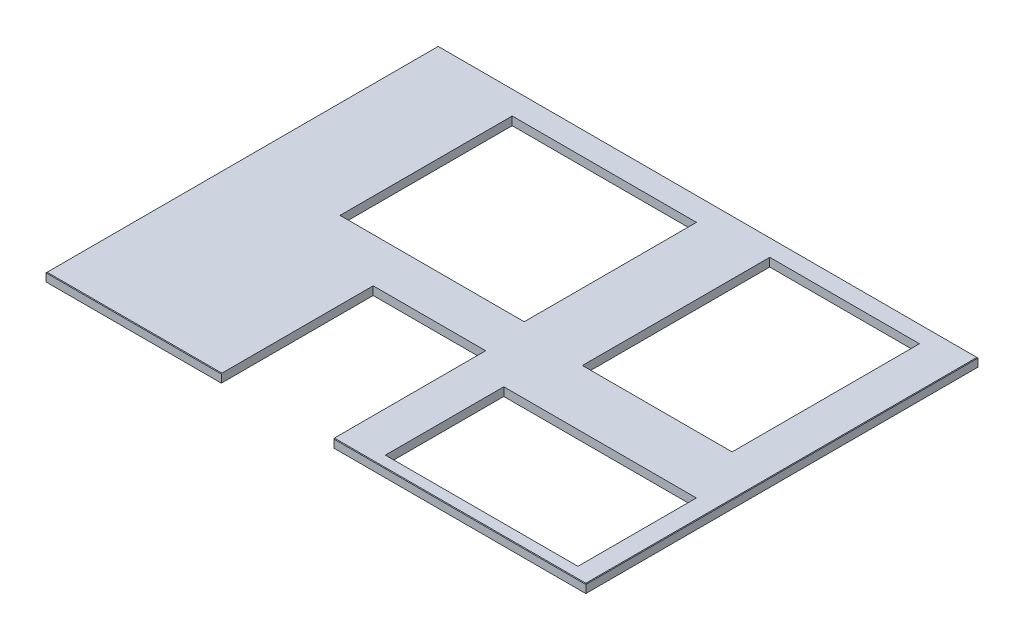
ISO-10303-21;
HEADER;
FILE_DESCRIPTION(('STEP AP214'),'2;1');
FILE_NAME('part.step','',(''),(''),'','','');
FILE_SCHEMA(('AUTOMOTIVE_DESIGN { 1 0 10303 214 1 1 1 1 }'));
ENDSEC;
DATA;
#1=APPLICATION_CONTEXT('core data for automotive mechanical design processes');
#2=APPLICATION_PROTOCOL_DEFINITION('international standard','automotive_design',2000,#1);
#3=PRODUCT_CONTEXT('',#1,'mechanical');
#4=PRODUCT('Part','Part','',(#3));
#5=PRODUCT_RELATED_PRODUCT_CATEGORY('part','',(#4));
#6=PRODUCT_DEFINITION_FORMATION('','',#4);
#7=PRODUCT_DEFINITION_CONTEXT('part definition',#1,'design');
#8=PRODUCT_DEFINITION('design','',#6,#7);
#9=PRODUCT_DEFINITION_SHAPE('','',#8);
#10=(LENGTH_UNIT() NAMED_UNIT(*) SI_UNIT(.MILLI.,.METRE.));
#11=(NAMED_UNIT(*) PLANE_ANGLE_UNIT() SI_UNIT($,.RADIAN.));
#12=(NAMED_UNIT(*) SI_UNIT($,.STERADIAN.) SOLID_ANGLE_UNIT());
#13=UNCERTAINTY_MEASURE_WITH_UNIT(LENGTH_MEASURE(1.E-05),#10,'distance_accuracy_value','');
#14=(GEOMETRIC_REPRESENTATION_CONTEXT(3) GLOBAL_UNCERTAINTY_ASSIGNED_CONTEXT((#13)) GLOBAL_UNIT_ASSIGNED_CONTEXT((#10,
#11,#12)) REPRESENTATION_CONTEXT('',''));
#15=CARTESIAN_POINT('',(0.,0.,0.));
#16=DIRECTION('',(0.,0.,1.));
#17=DIRECTION('',(1.,0.,0.));
#18=AXIS2_PLACEMENT_3D('',#15,#16,#17);
#19=CARTESIAN_POINT('',(0.,-38.1,0.));
#20=DIRECTION('',(0.,0.,1.));
#21=DIRECTION('',(1.,0.,0.));
#22=AXIS2_PLACEMENT_3D('',#19,#20,#21);
#23=PLANE('',#22);
#24=DIRECTION('',(0.,1.,0.));
#25=VECTOR('',#24,1.);
#26=CARTESIAN_POINT('',(792.1625,-38.1,0.));
#27=LINE('',#26,#25);
#28=CARTESIAN_POINT('',(792.1625,-38.1,0.));
#29=VERTEX_POINT('',#28);
#30=CARTESIAN_POINT('',(792.1625,-2.54000000000022,0.));
#31=VERTEX_POINT('',#30);
#32=EDGE_CURVE('E274',#29,#31,#27,.T.);
#33=ORIENTED_EDGE('',*,*,#32,.T.);
#34=DIRECTION('',(-1.,0.,0.));
#35=VECTOR('',#34,1.);
#36=CARTESIAN_POINT('',(0.,-2.54000000000021,0.));
#37=LINE('',#36,#35);
#38=CARTESIAN_POINT('',(0.,-2.54000000000022,0.));
#39=VERTEX_POINT('',#38);
#40=EDGE_CURVE('E365',#31,#39,#37,.T.);
#41=ORIENTED_EDGE('',*,*,#40,.T.);
#42=DIRECTION('',(0.,1.,0.));
#43=VECTOR('',#42,1.);
#44=CARTESIAN_POINT('',(0.,-38.1,0.));
#45=LINE('',#44,#43);
#46=CARTESIAN_POINT('',(0.,-38.1,0.));
#47=VERTEX_POINT('',#46);
#48=EDGE_CURVE('E336',#47,#39,#45,.T.);
#49=ORIENTED_EDGE('',*,*,#48,.F.);
#50=DIRECTION('',(1.,0.,0.));
#51=VECTOR('',#50,1.);
#52=CARTESIAN_POINT('',(0.,-38.1,0.));
#53=LINE('',#52,#51);
#54=EDGE_CURVE('E322',#47,#29,#53,.T.);
#55=ORIENTED_EDGE('',*,*,#54,.T.);
#56=EDGE_LOOP('',(#33,#41,#49,#55));
#57=FACE_BOUND('',#56,.T.);
#58=ADVANCED_FACE('F40',(#57),#23,.T.);
#59=CARTESIAN_POINT('',(0.,0.,-2.53999999999976));
#60=DIRECTION('',(0.,-0.707106781186485,-0.707106781186609));
#61=DIRECTION('',(1.,0.,0.));
#62=AXIS2_PLACEMENT_3D('',#59,#60,#61);
#63=PLANE('',#62);
#64=DIRECTION('',(0.,0.70710678118661,-0.707106781186486));
#65=VECTOR('',#64,1.);
#66=CARTESIAN_POINT('',(792.1625,0.,-2.53999999999983));
#67=LINE('',#66,#65);
#68=CARTESIAN_POINT('',(792.1625,0.,-2.53999999999976));
#69=VERTEX_POINT('',#68);
#70=EDGE_CURVE('E11',#69,#31,#67,.F.);
#71=ORIENTED_EDGE('',*,*,#70,.F.);
#72=DIRECTION('',(1.,0.,0.));
#73=VECTOR('',#72,1.);
#74=CARTESIAN_POINT('',(0.,0.,-2.53999999999976));
#75=LINE('',#74,#73);
#76=CARTESIAN_POINT('',(2.53999999999976,0.,-2.53999999999976));
#77=VERTEX_POINT('',#76);
#78=EDGE_CURVE('E348',#77,#69,#75,.T.);
#79=ORIENTED_EDGE('',*,*,#78,.F.);
#80=DIRECTION('',(-0.577350269189592,-0.577350269189693,0.577350269189592));
#81=VECTOR('',#80,1.);
#82=CARTESIAN_POINT('',(1.69333333333327,-0.846666666666637,-1.69333333333327));
#83=LINE('',#82,#81);
#84=EDGE_CURVE('E315',#39,#77,#83,.F.);
#85=ORIENTED_EDGE('',*,*,#84,.F.);
#86=ORIENTED_EDGE('',*,*,#40,.F.);
#87=EDGE_LOOP('',(#71,#79,#85,#86));
#88=FACE_BOUND('',#87,.T.);
#89=ADVANCED_FACE('F410',(#88),#63,.F.);
#90=DIRECTION('',(0.,1.,0.));
#91=VECTOR('',#90,1.);
#92=CARTESIAN_POINT('',(1300.1625,-38.1,0.));
#93=LINE('',#92,#91);
#94=CARTESIAN_POINT('',(1300.1625,-38.1,0.));
#95=VERTEX_POINT('',#94);
#96=CARTESIAN_POINT('',(1300.1625,-2.54000000000021,0.));
#97=VERTEX_POINT('',#96);
#98=EDGE_CURVE('E286',#95,#97,#93,.T.);
#99=ORIENTED_EDGE('',*,*,#98,.F.);
#100=CARTESIAN_POINT('',(2438.4,-38.1,0.));
#101=VERTEX_POINT('',#100);
#102=EDGE_CURVE('E326',#95,#101,#53,.T.);
#103=ORIENTED_EDGE('',*,*,#102,.T.);
#104=DIRECTION('',(0.,1.,0.));
#105=VECTOR('',#104,1.);
#106=CARTESIAN_POINT('',(2438.4,-38.1,0.));
#107=LINE('',#106,#105);
#108=CARTESIAN_POINT('',(2438.4,-2.54000000000022,0.));
#109=VERTEX_POINT('',#108);
#110=EDGE_CURVE('E335',#101,#109,#107,.T.);
#111=ORIENTED_EDGE('',*,*,#110,.T.);
#112=EDGE_CURVE('E366',#109,#97,#37,.T.);
#113=ORIENTED_EDGE('',*,*,#112,.T.);
#114=EDGE_LOOP('',(#99,#103,#111,#113));
#115=FACE_BOUND('',#114,.T.);
#116=ADVANCED_FACE('F420',(#115),#23,.T.);
#117=CARTESIAN_POINT('',(0.,-38.1,-1771.65));
#118=DIRECTION('',(-1.,0.,0.));
#119=DIRECTION('',(0.,0.,1.));
#120=AXIS2_PLACEMENT_3D('',#117,#118,#119);
#121=PLANE('',#120);
#122=ORIENTED_EDGE('',*,*,#48,.T.);
#123=DIRECTION('',(0.,0.,-1.));
#124=VECTOR('',#123,1.);
#125=CARTESIAN_POINT('',(0.,-2.54000000000021,-1771.65));
#126=LINE('',#125,#124);
#127=CARTESIAN_POINT('',(0.,-2.54000000000022,-1771.65));
#128=VERTEX_POINT('',#127);
#129=EDGE_CURVE('E358',#39,#128,#126,.T.);
#130=ORIENTED_EDGE('',*,*,#129,.T.);
#131=DIRECTION('',(0.,1.,0.));
#132=VECTOR('',#131,1.);
#133=CARTESIAN_POINT('',(0.,-38.1,-1771.65));
#134=LINE('',#133,#132);
#135=CARTESIAN_POINT('',(0.,-38.1,-1771.65));
#136=VERTEX_POINT('',#135);
#137=EDGE_CURVE('E340',#136,#128,#134,.T.);
#138=ORIENTED_EDGE('',*,*,#137,.F.);
#139=DIRECTION('',(0.,0.,1.));
#140=VECTOR('',#139,1.);
#141=CARTESIAN_POINT('',(0.,-38.1,-1771.65));
#142=LINE('',#141,#140);
#143=EDGE_CURVE('E332',#136,#47,#142,.T.);
#144=ORIENTED_EDGE('',*,*,#143,.T.);
#145=EDGE_LOOP('',(#122,#130,#138,#144));
#146=FACE_BOUND('',#145,.T.);
#147=ADVANCED_FACE('F430',(#146),#121,.T.);
#148=CARTESIAN_POINT('',(2438.4,-38.1,-1771.65));
#149=DIRECTION('',(0.,0.,-1.));
#150=DIRECTION('',(-1.,0.,0.));
#151=AXIS2_PLACEMENT_3D('',#148,#149,#150);
#152=PLANE('',#151);
#153=ORIENTED_EDGE('',*,*,#137,.T.);
#154=DIRECTION('',(1.,0.,0.));
#155=VECTOR('',#154,1.);
#156=CARTESIAN_POINT('',(2438.4,-2.54000000000021,-1771.65));
#157=LINE('',#156,#155);
#158=CARTESIAN_POINT('',(2438.4,-2.54000000000022,-1771.65));
#159=VERTEX_POINT('',#158);
#160=EDGE_CURVE('E361',#128,#159,#157,.T.);
#161=ORIENTED_EDGE('',*,*,#160,.T.);
#162=DIRECTION('',(0.,1.,0.));
#163=VECTOR('',#162,1.);
#164=CARTESIAN_POINT('',(2438.4,-38.1,-1771.65));
#165=LINE('',#164,#163);
#166=CARTESIAN_POINT('',(2438.4,-38.1,-1771.65));
#167=VERTEX_POINT('',#166);
#168=EDGE_CURVE('E343',#167,#159,#165,.T.);
#169=ORIENTED_EDGE('',*,*,#168,.F.);
#170=DIRECTION('',(-1.,0.,0.));
#171=VECTOR('',#170,1.);
#172=CARTESIAN_POINT('',(2438.4,-38.1,-1771.65));
#173=LINE('',#172,#171);
#174=EDGE_CURVE('E329',#167,#136,#173,.T.);
#175=ORIENTED_EDGE('',*,*,#174,.T.);
#176=EDGE_LOOP('',(#153,#161,#169,#175));
#177=FACE_BOUND('',#176,.T.);
#178=ADVANCED_FACE('F428',(#177),#152,.T.);
#179=CARTESIAN_POINT('',(2438.4,-38.1,0.));
#180=DIRECTION('',(1.,0.,0.));
#181=DIRECTION('',(0.,0.,-1.));
#182=AXIS2_PLACEMENT_3D('',#179,#180,#181);
#183=PLANE('',#182);
#184=ORIENTED_EDGE('',*,*,#168,.T.);
#185=DIRECTION('',(0.,0.,1.));
#186=VECTOR('',#185,1.);
#187=CARTESIAN_POINT('',(2438.4,-2.54000000000021,0.));
#188=LINE('',#187,#186);
#189=EDGE_CURVE('E363',#159,#109,#188,.T.);
#190=ORIENTED_EDGE('',*,*,#189,.T.);
#191=ORIENTED_EDGE('',*,*,#110,.F.);
#192=DIRECTION('',(0.,0.,-1.));
#193=VECTOR('',#192,1.);
#194=CARTESIAN_POINT('',(2438.4,-38.1,0.));
#195=LINE('',#194,#193);
#196=EDGE_CURVE('E325',#101,#167,#195,.T.);
#197=ORIENTED_EDGE('',*,*,#196,.T.);
#198=EDGE_LOOP('',(#184,#190,#191,#197));
#199=FACE_BOUND('',#198,.T.);
#200=ADVANCED_FACE('F426',(#199),#183,.T.);
#201=CARTESIAN_POINT('',(0.,-38.1,0.));
#202=DIRECTION('',(0.,1.,0.));
#203=DIRECTION('',(0.,0.,1.));
#204=AXIS2_PLACEMENT_3D('',#201,#202,#203);
#205=PLANE('',#204);
#206=DIRECTION('',(-1.,0.,0.));
#207=VECTOR('',#206,1.);
#208=CARTESIAN_POINT('',(441.799591690838,-38.1,-1664.06281503777));
#209=LINE('',#208,#207);
#210=CARTESIAN_POINT('',(1273.97070203891,-38.1,-1664.06281503777));
#211=VERTEX_POINT('',#210);
#212=CARTESIAN_POINT('',(441.799591690838,-38.1,-1664.06281503777));
#213=VERTEX_POINT('',#212);
#214=EDGE_CURVE('E203',#211,#213,#209,.T.);
#215=ORIENTED_EDGE('',*,*,#214,.T.);
#216=DIRECTION('',(0.,0.,1.));
#217=VECTOR('',#216,1.);
#218=CARTESIAN_POINT('',(441.799591690838,-38.1,-1664.06281503777));
#219=LINE('',#218,#217);
#220=CARTESIAN_POINT('',(441.799591690838,-38.1,-886.357665072126));
#221=VERTEX_POINT('',#220);
#222=EDGE_CURVE('E197',#213,#221,#219,.T.);
#223=ORIENTED_EDGE('',*,*,#222,.T.);
#224=DIRECTION('',(1.,0.,0.));
#225=VECTOR('',#224,1.);
#226=CARTESIAN_POINT('',(441.799591690838,-38.1,-886.357665072126));
#227=LINE('',#226,#225);
#228=CARTESIAN_POINT('',(1273.97070203891,-38.1,-886.357665072126));
#229=VERTEX_POINT('',#228);
#230=EDGE_CURVE('E206',#221,#229,#227,.T.);
#231=ORIENTED_EDGE('',*,*,#230,.T.);
#232=DIRECTION('',(0.,0.,-1.));
#233=VECTOR('',#232,1.);
#234=CARTESIAN_POINT('',(1273.97070203891,-38.1,-1664.06281503777));
#235=LINE('',#234,#233);
#236=EDGE_CURVE('E56',#229,#211,#235,.T.);
#237=ORIENTED_EDGE('',*,*,#236,.T.);
#238=EDGE_LOOP('',(#215,#223,#231,#237));
#239=FACE_BOUND('',#238,.T.);
#240=DIRECTION('',(1.,0.,0.));
#241=VECTOR('',#240,1.);
#242=CARTESIAN_POINT('',(1576.4256,-38.1,-846.57692));
#243=LINE('',#242,#241);
#244=CARTESIAN_POINT('',(1576.4256,-38.1,-846.57692));
#245=VERTEX_POINT('',#244);
#246=CARTESIAN_POINT('',(2252.62694,-38.1,-846.57692));
#247=VERTEX_POINT('',#246);
#248=EDGE_CURVE('E242',#245,#247,#243,.T.);
#249=ORIENTED_EDGE('',*,*,#248,.T.);
#250=DIRECTION('',(0.,0.,-1.));
#251=VECTOR('',#250,1.);
#252=CARTESIAN_POINT('',(2252.62694,-38.1,-1692.91));
#253=LINE('',#252,#251);
#254=CARTESIAN_POINT('',(2252.62694,-38.1,-1692.91));
#255=VERTEX_POINT('',#254);
#256=EDGE_CURVE('E232',#247,#255,#253,.T.);
#257=ORIENTED_EDGE('',*,*,#256,.T.);
#258=DIRECTION('',(-1.,0.,0.));
#259=VECTOR('',#258,1.);
#260=CARTESIAN_POINT('',(1576.4256,-38.1,-1692.91));
#261=LINE('',#260,#259);
#262=CARTESIAN_POINT('',(1576.4256,-38.1,-1692.91));
#263=VERTEX_POINT('',#262);
#264=EDGE_CURVE('E235',#255,#263,#261,.T.);
#265=ORIENTED_EDGE('',*,*,#264,.T.);
#266=DIRECTION('',(0.,0.,1.));
#267=VECTOR('',#266,1.);
#268=CARTESIAN_POINT('',(1576.4256,-38.1,-1692.91));
#269=LINE('',#268,#267);
#270=EDGE_CURVE('E239',#263,#245,#269,.T.);
#271=ORIENTED_EDGE('',*,*,#270,.T.);
#272=EDGE_LOOP('',(#249,#257,#265,#271));
#273=FACE_BOUND('',#272,.T.);
#274=DIRECTION('',(1.,0.,0.));
#275=VECTOR('',#274,1.);
#276=CARTESIAN_POINT('',(1482.09,-38.1,-50.8));
#277=LINE('',#276,#275);
#278=CARTESIAN_POINT('',(1482.09,-38.1,-50.8));
#279=VERTEX_POINT('',#278);
#280=CARTESIAN_POINT('',(2352.04,-38.1,-50.8));
#281=VERTEX_POINT('',#280);
#282=EDGE_CURVE('E300',#279,#281,#277,.T.);
#283=ORIENTED_EDGE('',*,*,#282,.T.);
#284=DIRECTION('',(0.,0.,-1.));
#285=VECTOR('',#284,1.);
#286=CARTESIAN_POINT('',(2352.04,-38.1,-585.7875));
#287=LINE('',#286,#285);
#288=CARTESIAN_POINT('',(2352.04,-38.1,-585.7875));
#289=VERTEX_POINT('',#288);
#290=EDGE_CURVE('E290',#281,#289,#287,.T.);
#291=ORIENTED_EDGE('',*,*,#290,.T.);
#292=DIRECTION('',(-1.,0.,0.));
#293=VECTOR('',#292,1.);
#294=CARTESIAN_POINT('',(1482.09,-38.1,-585.7875));
#295=LINE('',#294,#293);
#296=CARTESIAN_POINT('',(1482.09,-38.1,-585.7875));
#297=VERTEX_POINT('',#296);
#298=EDGE_CURVE('E293',#289,#297,#295,.T.);
#299=ORIENTED_EDGE('',*,*,#298,.T.);
#300=DIRECTION('',(0.,0.,1.));
#301=VECTOR('',#300,1.);
#302=CARTESIAN_POINT('',(1482.09,-38.1,-585.7875));
#303=LINE('',#302,#301);
#304=EDGE_CURVE('E297',#297,#279,#303,.T.);
#305=ORIENTED_EDGE('',*,*,#304,.T.);
#306=EDGE_LOOP('',(#283,#291,#299,#305));
#307=FACE_BOUND('',#306,.T.);
#308=DIRECTION('',(-1.,0.,0.));
#309=VECTOR('',#308,1.);
#310=CARTESIAN_POINT('',(792.1625,-38.1,-685.8));
#311=LINE('',#310,#309);
#312=CARTESIAN_POINT('',(1300.1625,-38.1,-685.8));
#313=VERTEX_POINT('',#312);
#314=CARTESIAN_POINT('',(792.1625,-38.1,-685.8));
#315=VERTEX_POINT('',#314);
#316=EDGE_CURVE('E271',#313,#315,#311,.T.);
#317=ORIENTED_EDGE('',*,*,#316,.T.);
#318=DIRECTION('',(0.,0.,1.));
#319=VECTOR('',#318,1.);
#320=CARTESIAN_POINT('',(792.1625,-38.1,-685.8));
#321=LINE('',#320,#319);
#322=EDGE_CURVE('E264',#315,#29,#321,.T.);
#323=ORIENTED_EDGE('',*,*,#322,.T.);
#324=ORIENTED_EDGE('',*,*,#54,.F.);
#325=ORIENTED_EDGE('',*,*,#143,.F.);
#326=ORIENTED_EDGE('',*,*,#174,.F.);
#327=ORIENTED_EDGE('',*,*,#196,.F.);
#328=ORIENTED_EDGE('',*,*,#102,.F.);
#329=DIRECTION('',(0.,0.,-1.));
#330=VECTOR('',#329,1.);
#331=CARTESIAN_POINT('',(1300.1625,-38.1,-685.8));
#332=LINE('',#331,#330);
#333=EDGE_CURVE('E267',#95,#313,#332,.T.);
#334=ORIENTED_EDGE('',*,*,#333,.T.);
#335=EDGE_LOOP('',(#317,#323,#324,#325,#326,#327,#328,#334));
#336=FACE_BOUND('',#335,.T.);
#337=ADVANCED_FACE('F210',(#239,#273,#307,#336),#205,.F.);
#338=CARTESIAN_POINT('',(0.,0.,0.));
#339=DIRECTION('',(0.,1.,0.));
#340=DIRECTION('',(0.,0.,1.));
#341=AXIS2_PLACEMENT_3D('',#338,#339,#340);
#342=PLANE('',#341);
#343=DIRECTION('',(0.,0.,1.));
#344=VECTOR('',#343,1.);
#345=CARTESIAN_POINT('',(441.799591690838,0.,-1664.06281503777));
#346=LINE('',#345,#344);
#347=CARTESIAN_POINT('',(441.799591690838,0.,-1664.06281503777));
#348=VERTEX_POINT('',#347);
#349=CARTESIAN_POINT('',(441.799591690838,0.,-886.357665072126));
#350=VERTEX_POINT('',#349);
#351=EDGE_CURVE('E64',#348,#350,#346,.T.);
#352=ORIENTED_EDGE('',*,*,#351,.F.);
#353=DIRECTION('',(-1.,0.,0.));
#354=VECTOR('',#353,1.);
#355=CARTESIAN_POINT('',(441.799591690838,0.,-1664.06281503777));
#356=LINE('',#355,#354);
#357=CARTESIAN_POINT('',(1273.97070203891,0.,-1664.06281503777));
#358=VERTEX_POINT('',#357);
#359=EDGE_CURVE('E213',#358,#348,#356,.T.);
#360=ORIENTED_EDGE('',*,*,#359,.F.);
#361=DIRECTION('',(0.,0.,-1.));
#362=VECTOR('',#361,1.);
#363=CARTESIAN_POINT('',(1273.97070203891,0.,-1664.06281503777));
#364=LINE('',#363,#362);
#365=CARTESIAN_POINT('',(1273.97070203891,0.,-886.357665072126));
#366=VERTEX_POINT('',#365);
#367=EDGE_CURVE('E216',#366,#358,#364,.T.);
#368=ORIENTED_EDGE('',*,*,#367,.F.);
#369=DIRECTION('',(1.,0.,0.));
#370=VECTOR('',#369,1.);
#371=CARTESIAN_POINT('',(441.799591690838,0.,-886.357665072126));
#372=LINE('',#371,#370);
#373=EDGE_CURVE('E222',#350,#366,#372,.T.);
#374=ORIENTED_EDGE('',*,*,#373,.F.);
#375=EDGE_LOOP('',(#352,#360,#368,#374));
#376=FACE_BOUND('',#375,.T.);
#377=DIRECTION('',(0.,0.,-1.));
#378=VECTOR('',#377,1.);
#379=CARTESIAN_POINT('',(2252.62694,0.,-1692.91));
#380=LINE('',#379,#378);
#381=CARTESIAN_POINT('',(2252.62694,0.,-846.57692));
#382=VERTEX_POINT('',#381);
#383=CARTESIAN_POINT('',(2252.62694,0.,-1692.91));
#384=VERTEX_POINT('',#383);
#385=EDGE_CURVE('E228',#382,#384,#380,.T.);
#386=ORIENTED_EDGE('',*,*,#385,.F.);
#387=DIRECTION('',(1.,0.,0.));
#388=VECTOR('',#387,1.);
#389=CARTESIAN_POINT('',(1576.4256,0.,-846.57692));
#390=LINE('',#389,#388);
#391=CARTESIAN_POINT('',(1576.4256,0.,-846.57692));
#392=VERTEX_POINT('',#391);
#393=EDGE_CURVE('E236',#392,#382,#390,.T.);
#394=ORIENTED_EDGE('',*,*,#393,.F.);
#395=DIRECTION('',(0.,0.,1.));
#396=VECTOR('',#395,1.);
#397=CARTESIAN_POINT('',(1576.4256,0.,-1692.91));
#398=LINE('',#397,#396);
#399=CARTESIAN_POINT('',(1576.4256,0.,-1692.91));
#400=VERTEX_POINT('',#399);
#401=EDGE_CURVE('E250',#400,#392,#398,.T.);
#402=ORIENTED_EDGE('',*,*,#401,.F.);
#403=DIRECTION('',(-1.,0.,0.));
#404=VECTOR('',#403,1.);
#405=CARTESIAN_POINT('',(1576.4256,0.,-1692.91));
#406=LINE('',#405,#404);
#407=EDGE_CURVE('E247',#384,#400,#406,.T.);
#408=ORIENTED_EDGE('',*,*,#407,.F.);
#409=EDGE_LOOP('',(#386,#394,#402,#408));
#410=FACE_BOUND('',#409,.T.);
#411=DIRECTION('',(0.,0.,1.));
#412=VECTOR('',#411,1.);
#413=CARTESIAN_POINT('',(792.1625,0.,-685.8));
#414=LINE('',#413,#412);
#415=CARTESIAN_POINT('',(792.1625,0.,-685.8));
#416=VERTEX_POINT('',#415);
#417=EDGE_CURVE('E257',#416,#69,#414,.T.);
#418=ORIENTED_EDGE('',*,*,#417,.F.);
#419=DIRECTION('',(-1.,0.,0.));
#420=VECTOR('',#419,1.);
#421=CARTESIAN_POINT('',(792.1625,0.,-685.8));
#422=LINE('',#421,#420);
#423=CARTESIAN_POINT('',(1300.1625,0.,-685.8));
#424=VERTEX_POINT('',#423);
#425=EDGE_CURVE('E268',#424,#416,#422,.T.);
#426=ORIENTED_EDGE('',*,*,#425,.F.);
#427=DIRECTION('',(0.,0.,-1.));
#428=VECTOR('',#427,1.);
#429=CARTESIAN_POINT('',(1300.1625,0.,-685.8));
#430=LINE('',#429,#428);
#431=CARTESIAN_POINT('',(1300.1625,0.,-2.53999999999976));
#432=VERTEX_POINT('',#431);
#433=EDGE_CURVE('E276',#432,#424,#430,.T.);
#434=ORIENTED_EDGE('',*,*,#433,.F.);
#435=CARTESIAN_POINT('',(2435.86,0.,-2.53999999999976));
#436=VERTEX_POINT('',#435);
#437=EDGE_CURVE('E339',#432,#436,#75,.T.);
#438=ORIENTED_EDGE('',*,*,#437,.T.);
#439=DIRECTION('',(0.,0.,-1.));
#440=VECTOR('',#439,1.);
#441=CARTESIAN_POINT('',(2435.86,0.,0.));
#442=LINE('',#441,#440);
#443=CARTESIAN_POINT('',(2435.86,0.,-1769.11));
#444=VERTEX_POINT('',#443);
#445=EDGE_CURVE('E351',#436,#444,#442,.T.);
#446=ORIENTED_EDGE('',*,*,#445,.T.);
#447=DIRECTION('',(-1.,0.,0.));
#448=VECTOR('',#447,1.);
#449=CARTESIAN_POINT('',(-1.61097986802379E-13,0.,-1769.11));
#450=LINE('',#449,#448);
#451=CARTESIAN_POINT('',(2.53999999999976,0.,-1769.11));
#452=VERTEX_POINT('',#451);
#453=EDGE_CURVE('E353',#444,#452,#450,.T.);
#454=ORIENTED_EDGE('',*,*,#453,.T.);
#455=DIRECTION('',(0.,0.,1.));
#456=VECTOR('',#455,1.);
#457=CARTESIAN_POINT('',(2.53999999999976,0.,0.));
#458=LINE('',#457,#456);
#459=EDGE_CURVE('E355',#452,#77,#458,.T.);
#460=ORIENTED_EDGE('',*,*,#459,.T.);
#461=ORIENTED_EDGE('',*,*,#78,.T.);
#462=EDGE_LOOP('',(#418,#426,#434,#438,#446,#454,#460,#461));
#463=FACE_BOUND('',#462,.T.);
#464=DIRECTION('',(0.,0.,-1.));
#465=VECTOR('',#464,1.);
#466=CARTESIAN_POINT('',(2352.04,0.,-585.7875));
#467=LINE('',#466,#465);
#468=CARTESIAN_POINT('',(2352.04,0.,-50.8));
#469=VERTEX_POINT('',#468);
#470=CARTESIAN_POINT('',(2352.04,0.,-585.7875));
#471=VERTEX_POINT('',#470);
#472=EDGE_CURVE('E282',#469,#471,#467,.T.);
#473=ORIENTED_EDGE('',*,*,#472,.F.);
#474=DIRECTION('',(1.,0.,0.));
#475=VECTOR('',#474,1.);
#476=CARTESIAN_POINT('',(1482.09,0.,-50.8));
#477=LINE('',#476,#475);
#478=CARTESIAN_POINT('',(1482.09,0.,-50.8));
#479=VERTEX_POINT('',#478);
#480=EDGE_CURVE('E294',#479,#469,#477,.T.);
#481=ORIENTED_EDGE('',*,*,#480,.F.);
#482=DIRECTION('',(0.,0.,1.));
#483=VECTOR('',#482,1.);
#484=CARTESIAN_POINT('',(1482.09,0.,-585.7875));
#485=LINE('',#484,#483);
#486=CARTESIAN_POINT('',(1482.09,0.,-585.7875));
#487=VERTEX_POINT('',#486);
#488=EDGE_CURVE('E308',#487,#479,#485,.T.);
#489=ORIENTED_EDGE('',*,*,#488,.F.);
#490=DIRECTION('',(-1.,0.,0.));
#491=VECTOR('',#490,1.);
#492=CARTESIAN_POINT('',(1482.09,0.,-585.7875));
#493=LINE('',#492,#491);
#494=EDGE_CURVE('E305',#471,#487,#493,.T.);
#495=ORIENTED_EDGE('',*,*,#494,.F.);
#496=EDGE_LOOP('',(#473,#481,#489,#495));
#497=FACE_BOUND('',#496,.T.);
#498=ADVANCED_FACE('F388',(#376,#410,#463,#497),#342,.T.);
#499=CARTESIAN_POINT('',(2435.86,0.,0.));
#500=DIRECTION('',(-0.707106781186609,-0.707106781186486,0.));
#501=DIRECTION('',(0.,0.,-1.));
#502=AXIS2_PLACEMENT_3D('',#499,#500,#501);
#503=PLANE('',#502);
#504=DIRECTION('',(-0.577350269189592,0.577350269189693,-0.577350269189592));
#505=VECTOR('',#504,1.);
#506=CARTESIAN_POINT('',(1623.90666666676,811.953333333381,-814.493333333239));
#507=LINE('',#506,#505);
#508=EDGE_CURVE('E372',#109,#436,#507,.T.);
#509=ORIENTED_EDGE('',*,*,#508,.F.);
#510=ORIENTED_EDGE('',*,*,#189,.F.);
#511=DIRECTION('',(-0.577350269189609,0.57735026918971,0.577350269189558));
#512=VECTOR('',#511,1.);
#513=CARTESIAN_POINT('',(1846.15666666675,589.703333333351,-1179.4066666668));
#514=LINE('',#513,#512);
#515=EDGE_CURVE('E375',#444,#159,#514,.F.);
#516=ORIENTED_EDGE('',*,*,#515,.F.);
#517=ORIENTED_EDGE('',*,*,#445,.F.);
#518=EDGE_LOOP('',(#509,#510,#516,#517));
#519=FACE_BOUND('',#518,.T.);
#520=ADVANCED_FACE('F43',(#519),#503,.F.);
#521=CARTESIAN_POINT('',(-1.61097986802379E-13,0.,-1769.11));
#522=DIRECTION('',(0.,-0.707106781186455,0.70710678118664));
#523=DIRECTION('',(-1.,0.,0.));
#524=AXIS2_PLACEMENT_3D('',#521,#522,#523);
#525=PLANE('',#524);
#526=ORIENTED_EDGE('',*,*,#515,.T.);
#527=ORIENTED_EDGE('',*,*,#160,.F.);
#528=DIRECTION('',(0.577350269189609,0.57735026918971,0.577350269189558));
#529=VECTOR('',#528,1.);
#530=CARTESIAN_POINT('',(1.69333333333317,-0.84666666666674,-1769.95666666667));
#531=LINE('',#530,#529);
#532=EDGE_CURVE('E370',#452,#128,#531,.F.);
#533=ORIENTED_EDGE('',*,*,#532,.F.);
#534=ORIENTED_EDGE('',*,*,#453,.F.);
#535=EDGE_LOOP('',(#526,#527,#533,#534));
#536=FACE_BOUND('',#535,.T.);
#537=ADVANCED_FACE('F401',(#536),#525,.F.);
#538=DIRECTION('',(0.,-0.70710678118661,0.707106781186486));
#539=VECTOR('',#538,1.);
#540=CARTESIAN_POINT('',(1300.1625,0.,-2.53999999999976));
#541=LINE('',#540,#539);
#542=EDGE_CURVE('E49',#97,#432,#541,.F.);
#543=ORIENTED_EDGE('',*,*,#542,.F.);
#544=ORIENTED_EDGE('',*,*,#112,.F.);
#545=ORIENTED_EDGE('',*,*,#508,.T.);
#546=ORIENTED_EDGE('',*,*,#437,.F.);
#547=EDGE_LOOP('',(#543,#544,#545,#546));
#548=FACE_BOUND('',#547,.T.);
#549=ADVANCED_FACE('F391',(#548),#63,.F.);
#550=CARTESIAN_POINT('',(2.53999999999976,0.,0.));
#551=DIRECTION('',(0.707106781186609,-0.707106781186485,0.));
#552=DIRECTION('',(0.,0.,1.));
#553=AXIS2_PLACEMENT_3D('',#550,#551,#552);
#554=PLANE('',#553);
#555=ORIENTED_EDGE('',*,*,#532,.T.);
#556=ORIENTED_EDGE('',*,*,#129,.F.);
#557=ORIENTED_EDGE('',*,*,#84,.T.);
#558=ORIENTED_EDGE('',*,*,#459,.F.);
#559=EDGE_LOOP('',(#555,#556,#557,#558));
#560=FACE_BOUND('',#559,.T.);
#561=ADVANCED_FACE('F404',(#560),#554,.F.);
#562=CARTESIAN_POINT('',(2352.04,-38.1,-585.7875));
#563=DIRECTION('',(1.,0.,0.));
#564=DIRECTION('',(0.,0.,-1.));
#565=AXIS2_PLACEMENT_3D('',#562,#563,#564);
#566=PLANE('',#565);
#567=ORIENTED_EDGE('',*,*,#472,.T.);
#568=DIRECTION('',(0.,1.,0.));
#569=VECTOR('',#568,1.);
#570=CARTESIAN_POINT('',(2352.04,-38.1,-585.7875));
#571=LINE('',#570,#569);
#572=EDGE_CURVE('E303',#289,#471,#571,.T.);
#573=ORIENTED_EDGE('',*,*,#572,.F.);
#574=ORIENTED_EDGE('',*,*,#290,.F.);
#575=DIRECTION('',(0.,1.,0.));
#576=VECTOR('',#575,1.);
#577=CARTESIAN_POINT('',(2352.04,-38.1,-50.8));
#578=LINE('',#577,#576);
#579=EDGE_CURVE('E313',#281,#469,#578,.T.);
#580=ORIENTED_EDGE('',*,*,#579,.T.);
#581=EDGE_LOOP('',(#567,#573,#574,#580));
#582=FACE_BOUND('',#581,.T.);
#583=ADVANCED_FACE('F465',(#582),#566,.F.);
#584=CARTESIAN_POINT('',(1482.09,-38.1,-50.8));
#585=DIRECTION('',(0.,0.,1.));
#586=DIRECTION('',(1.,0.,0.));
#587=AXIS2_PLACEMENT_3D('',#584,#585,#586);
#588=PLANE('',#587);
#589=ORIENTED_EDGE('',*,*,#480,.T.);
#590=ORIENTED_EDGE('',*,*,#579,.F.);
#591=ORIENTED_EDGE('',*,*,#282,.F.);
#592=DIRECTION('',(0.,1.,0.));
#593=VECTOR('',#592,1.);
#594=CARTESIAN_POINT('',(1482.09,-38.1,-50.8));
#595=LINE('',#594,#593);
#596=EDGE_CURVE('E316',#279,#479,#595,.T.);
#597=ORIENTED_EDGE('',*,*,#596,.T.);
#598=EDGE_LOOP('',(#589,#590,#591,#597));
#599=FACE_BOUND('',#598,.T.);
#600=ADVANCED_FACE('F468',(#599),#588,.F.);
#601=CARTESIAN_POINT('',(1482.09,-38.1,-585.7875));
#602=DIRECTION('',(-1.,0.,0.));
#603=DIRECTION('',(0.,0.,1.));
#604=AXIS2_PLACEMENT_3D('',#601,#602,#603);
#605=PLANE('',#604);
#606=ORIENTED_EDGE('',*,*,#488,.T.);
#607=ORIENTED_EDGE('',*,*,#596,.F.);
#608=ORIENTED_EDGE('',*,*,#304,.F.);
#609=DIRECTION('',(0.,1.,0.));
#610=VECTOR('',#609,1.);
#611=CARTESIAN_POINT('',(1482.09,-38.1,-585.7875));
#612=LINE('',#611,#610);
#613=EDGE_CURVE('E318',#297,#487,#612,.T.);
#614=ORIENTED_EDGE('',*,*,#613,.T.);
#615=EDGE_LOOP('',(#606,#607,#608,#614));
#616=FACE_BOUND('',#615,.T.);
#617=ADVANCED_FACE('F472',(#616),#605,.F.);
#618=CARTESIAN_POINT('',(1482.09,-38.1,-585.7875));
#619=DIRECTION('',(0.,0.,-1.));
#620=DIRECTION('',(-1.,0.,0.));
#621=AXIS2_PLACEMENT_3D('',#618,#619,#620);
#622=PLANE('',#621);
#623=ORIENTED_EDGE('',*,*,#494,.T.);
#624=ORIENTED_EDGE('',*,*,#613,.F.);
#625=ORIENTED_EDGE('',*,*,#298,.F.);
#626=ORIENTED_EDGE('',*,*,#572,.T.);
#627=EDGE_LOOP('',(#623,#624,#625,#626));
#628=FACE_BOUND('',#627,.T.);
#629=ADVANCED_FACE('F470',(#628),#622,.F.);
#630=CARTESIAN_POINT('',(792.1625,-38.1,-685.8));
#631=DIRECTION('',(-1.,0.,0.));
#632=DIRECTION('',(0.,0.,1.));
#633=AXIS2_PLACEMENT_3D('',#630,#631,#632);
#634=PLANE('',#633);
#635=ORIENTED_EDGE('',*,*,#70,.T.);
#636=ORIENTED_EDGE('',*,*,#32,.F.);
#637=ORIENTED_EDGE('',*,*,#322,.F.);
#638=DIRECTION('',(0.,1.,0.));
#639=VECTOR('',#638,1.);
#640=CARTESIAN_POINT('',(792.1625,-38.1,-685.8));
#641=LINE('',#640,#639);
#642=EDGE_CURVE('E280',#315,#416,#641,.T.);
#643=ORIENTED_EDGE('',*,*,#642,.T.);
#644=ORIENTED_EDGE('',*,*,#417,.T.);
#645=EDGE_LOOP('',(#635,#636,#637,#643,#644));
#646=FACE_BOUND('',#645,.T.);
#647=ADVANCED_FACE('F412',(#646),#634,.F.);
#648=CARTESIAN_POINT('',(792.1625,-38.1,-685.8));
#649=DIRECTION('',(0.,0.,-1.));
#650=DIRECTION('',(-1.,0.,0.));
#651=AXIS2_PLACEMENT_3D('',#648,#649,#650);
#652=PLANE('',#651);
#653=ORIENTED_EDGE('',*,*,#425,.T.);
#654=ORIENTED_EDGE('',*,*,#642,.F.);
#655=ORIENTED_EDGE('',*,*,#316,.F.);
#656=DIRECTION('',(0.,1.,0.));
#657=VECTOR('',#656,1.);
#658=CARTESIAN_POINT('',(1300.1625,-38.1,-685.8));
#659=LINE('',#658,#657);
#660=EDGE_CURVE('E283',#313,#424,#659,.T.);
#661=ORIENTED_EDGE('',*,*,#660,.T.);
#662=EDGE_LOOP('',(#653,#654,#655,#661));
#663=FACE_BOUND('',#662,.T.);
#664=ADVANCED_FACE('F416',(#663),#652,.F.);
#665=CARTESIAN_POINT('',(1300.1625,-38.1,-685.8));
#666=DIRECTION('',(1.,0.,0.));
#667=DIRECTION('',(0.,0.,-1.));
#668=AXIS2_PLACEMENT_3D('',#665,#666,#667);
#669=PLANE('',#668);
#670=ORIENTED_EDGE('',*,*,#542,.T.);
#671=ORIENTED_EDGE('',*,*,#433,.T.);
#672=ORIENTED_EDGE('',*,*,#660,.F.);
#673=ORIENTED_EDGE('',*,*,#333,.F.);
#674=ORIENTED_EDGE('',*,*,#98,.T.);
#675=EDGE_LOOP('',(#670,#671,#672,#673,#674));
#676=FACE_BOUND('',#675,.T.);
#677=ADVANCED_FACE('F380',(#676),#669,.F.);
#678=CARTESIAN_POINT('',(2252.62694,-38.1,-1692.91));
#679=DIRECTION('',(1.,0.,0.));
#680=DIRECTION('',(0.,0.,-1.));
#681=AXIS2_PLACEMENT_3D('',#678,#679,#680);
#682=PLANE('',#681);
#683=ORIENTED_EDGE('',*,*,#385,.T.);
#684=DIRECTION('',(0.,1.,0.));
#685=VECTOR('',#684,1.);
#686=CARTESIAN_POINT('',(2252.62694,-38.1,-1692.91));
#687=LINE('',#686,#685);
#688=EDGE_CURVE('E245',#255,#384,#687,.T.);
#689=ORIENTED_EDGE('',*,*,#688,.F.);
#690=ORIENTED_EDGE('',*,*,#256,.F.);
#691=DIRECTION('',(0.,1.,0.));
#692=VECTOR('',#691,1.);
#693=CARTESIAN_POINT('',(2252.62694,-38.1,-846.57692));
#694=LINE('',#693,#692);
#695=EDGE_CURVE('E255',#247,#382,#694,.T.);
#696=ORIENTED_EDGE('',*,*,#695,.T.);
#697=EDGE_LOOP('',(#683,#689,#690,#696));
#698=FACE_BOUND('',#697,.T.);
#699=ADVANCED_FACE('F484',(#698),#682,.F.);
#700=CARTESIAN_POINT('',(1576.4256,-38.1,-846.57692));
#701=DIRECTION('',(0.,0.,1.));
#702=DIRECTION('',(1.,0.,0.));
#703=AXIS2_PLACEMENT_3D('',#700,#701,#702);
#704=PLANE('',#703);
#705=ORIENTED_EDGE('',*,*,#393,.T.);
#706=ORIENTED_EDGE('',*,*,#695,.F.);
#707=ORIENTED_EDGE('',*,*,#248,.F.);
#708=DIRECTION('',(0.,1.,0.));
#709=VECTOR('',#708,1.);
#710=CARTESIAN_POINT('',(1576.4256,-38.1,-846.57692));
#711=LINE('',#710,#709);
#712=EDGE_CURVE('E258',#245,#392,#711,.T.);
#713=ORIENTED_EDGE('',*,*,#712,.T.);
#714=EDGE_LOOP('',(#705,#706,#707,#713));
#715=FACE_BOUND('',#714,.T.);
#716=ADVANCED_FACE('F489',(#715),#704,.F.);
#717=CARTESIAN_POINT('',(1576.4256,-38.1,-1692.91));
#718=DIRECTION('',(-1.,0.,0.));
#719=DIRECTION('',(0.,0.,1.));
#720=AXIS2_PLACEMENT_3D('',#717,#718,#719);
#721=PLANE('',#720);
#722=ORIENTED_EDGE('',*,*,#401,.T.);
#723=ORIENTED_EDGE('',*,*,#712,.F.);
#724=ORIENTED_EDGE('',*,*,#270,.F.);
#725=DIRECTION('',(0.,1.,0.));
#726=VECTOR('',#725,1.);
#727=CARTESIAN_POINT('',(1576.4256,-38.1,-1692.91));
#728=LINE('',#727,#726);
#729=EDGE_CURVE('E260',#263,#400,#728,.T.);
#730=ORIENTED_EDGE('',*,*,#729,.T.);
#731=EDGE_LOOP('',(#722,#723,#724,#730));
#732=FACE_BOUND('',#731,.T.);
#733=ADVANCED_FACE('F493',(#732),#721,.F.);
#734=CARTESIAN_POINT('',(1576.4256,-38.1,-1692.91));
#735=DIRECTION('',(0.,0.,-1.));
#736=DIRECTION('',(-1.,0.,0.));
#737=AXIS2_PLACEMENT_3D('',#734,#735,#736);
#738=PLANE('',#737);
#739=ORIENTED_EDGE('',*,*,#407,.T.);
#740=ORIENTED_EDGE('',*,*,#729,.F.);
#741=ORIENTED_EDGE('',*,*,#264,.F.);
#742=ORIENTED_EDGE('',*,*,#688,.T.);
#743=EDGE_LOOP('',(#739,#740,#741,#742));
#744=FACE_BOUND('',#743,.T.);
#745=ADVANCED_FACE('F491',(#744),#738,.F.);
#746=CARTESIAN_POINT('',(441.799591690838,-38.1,-1664.06281503777));
#747=DIRECTION('',(-1.,0.,0.));
#748=DIRECTION('',(0.,0.,1.));
#749=AXIS2_PLACEMENT_3D('',#746,#747,#748);
#750=PLANE('',#749);
#751=ORIENTED_EDGE('',*,*,#351,.T.);
#752=DIRECTION('',(0.,1.,0.));
#753=VECTOR('',#752,1.);
#754=CARTESIAN_POINT('',(441.799591690838,-38.1,-886.357665072126));
#755=LINE('',#754,#753);
#756=EDGE_CURVE('E193',#221,#350,#755,.T.);
#757=ORIENTED_EDGE('',*,*,#756,.F.);
#758=ORIENTED_EDGE('',*,*,#222,.F.);
#759=DIRECTION('',(0.,1.,0.));
#760=VECTOR('',#759,1.);
#761=CARTESIAN_POINT('',(441.799591690838,-38.1,-1664.06281503777));
#762=LINE('',#761,#760);
#763=EDGE_CURVE('E226',#213,#348,#762,.T.);
#764=ORIENTED_EDGE('',*,*,#763,.T.);
#765=EDGE_LOOP('',(#751,#757,#758,#764));
#766=FACE_BOUND('',#765,.T.);
#767=ADVANCED_FACE('F195',(#766),#750,.F.);
#768=CARTESIAN_POINT('',(441.799591690838,-38.1,-1664.06281503777));
#769=DIRECTION('',(0.,0.,-1.));
#770=DIRECTION('',(-1.,0.,0.));
#771=AXIS2_PLACEMENT_3D('',#768,#769,#770);
#772=PLANE('',#771);
#773=ORIENTED_EDGE('',*,*,#359,.T.);
#774=ORIENTED_EDGE('',*,*,#763,.F.);
#775=ORIENTED_EDGE('',*,*,#214,.F.);
#776=DIRECTION('',(0.,1.,0.));
#777=VECTOR('',#776,1.);
#778=CARTESIAN_POINT('',(1273.97070203891,-38.1,-1664.06281503777));
#779=LINE('',#778,#777);
#780=EDGE_CURVE('E229',#211,#358,#779,.T.);
#781=ORIENTED_EDGE('',*,*,#780,.T.);
#782=EDGE_LOOP('',(#773,#774,#775,#781));
#783=FACE_BOUND('',#782,.T.);
#784=ADVANCED_FACE('F503',(#783),#772,.F.);
#785=CARTESIAN_POINT('',(1273.97070203891,-38.1,-1664.06281503777));
#786=DIRECTION('',(1.,0.,0.));
#787=DIRECTION('',(0.,0.,-1.));
#788=AXIS2_PLACEMENT_3D('',#785,#786,#787);
#789=PLANE('',#788);
#790=ORIENTED_EDGE('',*,*,#367,.T.);
#791=ORIENTED_EDGE('',*,*,#780,.F.);
#792=ORIENTED_EDGE('',*,*,#236,.F.);
#793=DIRECTION('',(0.,1.,0.));
#794=VECTOR('',#793,1.);
#795=CARTESIAN_POINT('',(1273.97070203891,-38.1,-886.357665072126));
#796=LINE('',#795,#794);
#797=EDGE_CURVE('E202',#229,#366,#796,.T.);
#798=ORIENTED_EDGE('',*,*,#797,.T.);
#799=EDGE_LOOP('',(#790,#791,#792,#798));
#800=FACE_BOUND('',#799,.T.);
#801=ADVANCED_FACE('F506',(#800),#789,.F.);
#802=CARTESIAN_POINT('',(441.799591690838,-38.1,-886.357665072126));
#803=DIRECTION('',(0.,0.,1.));
#804=DIRECTION('',(1.,0.,0.));
#805=AXIS2_PLACEMENT_3D('',#802,#803,#804);
#806=PLANE('',#805);
#807=ORIENTED_EDGE('',*,*,#373,.T.);
#808=ORIENTED_EDGE('',*,*,#797,.F.);
#809=ORIENTED_EDGE('',*,*,#230,.F.);
#810=ORIENTED_EDGE('',*,*,#756,.T.);
#811=EDGE_LOOP('',(#807,#808,#809,#810));
#812=FACE_BOUND('',#811,.T.);
#813=ADVANCED_FACE('F207',(#812),#806,.F.);
#814=CLOSED_SHELL('',(#58,#89,#116,#147,#178,#200,#337,#498,#520,#537,#549,#561,#583,#600,#617,
#629,#647,#664,#677,#699,#716,#733,#745,#767,#784,#801,#813));
#815=MANIFOLD_SOLID_BREP('B2',#814);
#816=ADVANCED_BREP_SHAPE_REPRESENTATION('',(#18,#815),#14);
#817=SHAPE_DEFINITION_REPRESENTATION(#9,#816);
ENDSEC;
END-ISO-10303-21;
